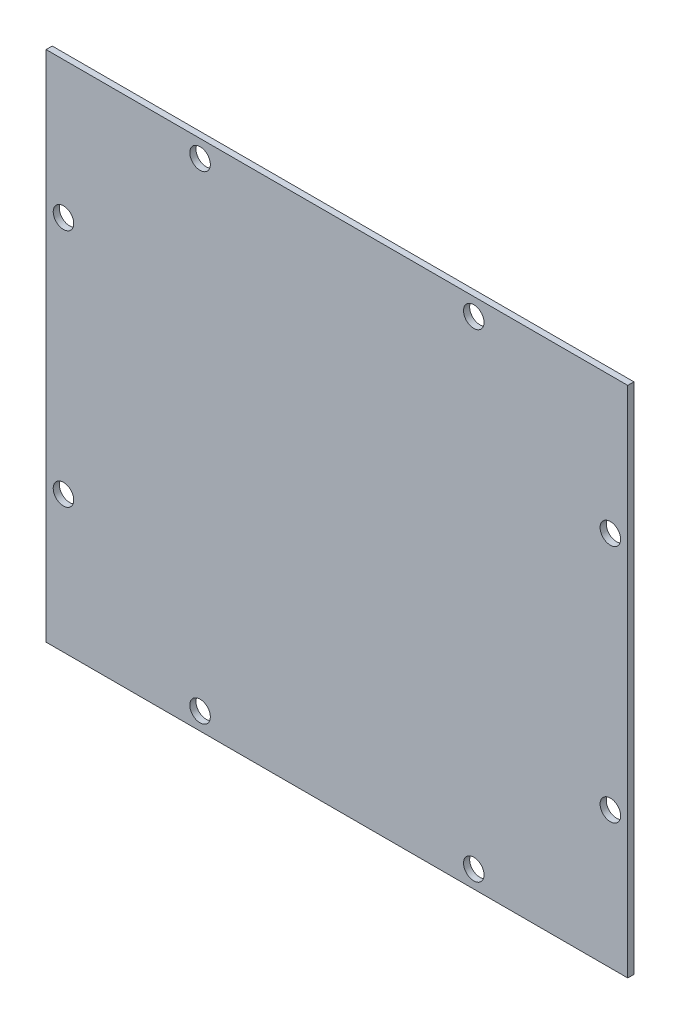
ISO-10303-21;
HEADER;
FILE_DESCRIPTION(('STEP AP214'),'2;1');
FILE_NAME('part.step','',(''),(''),'','','');
FILE_SCHEMA(('AUTOMOTIVE_DESIGN { 1 0 10303 214 1 1 1 1 }'));
ENDSEC;
DATA;
#1=APPLICATION_CONTEXT('core data for automotive mechanical design processes');
#2=APPLICATION_PROTOCOL_DEFINITION('international standard','automotive_design',2000,#1);
#3=PRODUCT_CONTEXT('',#1,'mechanical');
#4=PRODUCT('Part','Part','',(#3));
#5=PRODUCT_RELATED_PRODUCT_CATEGORY('part','',(#4));
#6=PRODUCT_DEFINITION_FORMATION('','',#4);
#7=PRODUCT_DEFINITION_CONTEXT('part definition',#1,'design');
#8=PRODUCT_DEFINITION('design','',#6,#7);
#9=PRODUCT_DEFINITION_SHAPE('','',#8);
#10=(LENGTH_UNIT() NAMED_UNIT(*) SI_UNIT(.MILLI.,.METRE.));
#11=(NAMED_UNIT(*) PLANE_ANGLE_UNIT() SI_UNIT($,.RADIAN.));
#12=(NAMED_UNIT(*) SI_UNIT($,.STERADIAN.) SOLID_ANGLE_UNIT());
#13=UNCERTAINTY_MEASURE_WITH_UNIT(LENGTH_MEASURE(1.E-05),#10,'distance_accuracy_value','');
#14=(GEOMETRIC_REPRESENTATION_CONTEXT(3) GLOBAL_UNCERTAINTY_ASSIGNED_CONTEXT((#13)) GLOBAL_UNIT_ASSIGNED_CONTEXT((#10,
#11,#12)) REPRESENTATION_CONTEXT('',''));
#15=CARTESIAN_POINT('',(0.,0.,0.));
#16=DIRECTION('',(0.,0.,1.));
#17=DIRECTION('',(1.,0.,0.));
#18=AXIS2_PLACEMENT_3D('',#15,#16,#17);
#19=CARTESIAN_POINT('',(212.5,-187.5,-4.5));
#20=DIRECTION('',(1.,0.,0.));
#21=DIRECTION('',(0.,0.,-1.));
#22=AXIS2_PLACEMENT_3D('',#19,#20,#21);
#23=PLANE('',#22);
#24=DIRECTION('',(0.,1.,0.));
#25=VECTOR('',#24,1.);
#26=CARTESIAN_POINT('',(212.5,-187.5,0.));
#27=LINE('',#26,#25);
#28=CARTESIAN_POINT('',(212.5,-187.5,0.));
#29=VERTEX_POINT('',#28);
#30=CARTESIAN_POINT('',(212.5,187.5,0.));
#31=VERTEX_POINT('',#30);
#32=EDGE_CURVE('E121',#29,#31,#27,.T.);
#33=ORIENTED_EDGE('',*,*,#32,.F.);
#34=DIRECTION('',(0.,0.,1.));
#35=VECTOR('',#34,1.);
#36=CARTESIAN_POINT('',(212.5,-187.5,-4.5));
#37=LINE('',#36,#35);
#38=CARTESIAN_POINT('',(212.5,-187.5,-4.5));
#39=VERTEX_POINT('',#38);
#40=EDGE_CURVE('E11',#39,#29,#37,.T.);
#41=ORIENTED_EDGE('',*,*,#40,.F.);
#42=DIRECTION('',(0.,1.,0.));
#43=VECTOR('',#42,1.);
#44=CARTESIAN_POINT('',(212.5,-187.5,-4.5));
#45=LINE('',#44,#43);
#46=CARTESIAN_POINT('',(212.5,187.5,-4.5));
#47=VERTEX_POINT('',#46);
#48=EDGE_CURVE('E112',#39,#47,#45,.T.);
#49=ORIENTED_EDGE('',*,*,#48,.T.);
#50=DIRECTION('',(0.,0.,1.));
#51=VECTOR('',#50,1.);
#52=CARTESIAN_POINT('',(212.5,187.5,-4.5));
#53=LINE('',#52,#51);
#54=EDGE_CURVE('E94',#47,#31,#53,.T.);
#55=ORIENTED_EDGE('',*,*,#54,.T.);
#56=EDGE_LOOP('',(#33,#41,#49,#55));
#57=FACE_BOUND('',#56,.T.);
#58=ADVANCED_FACE('F46',(#57),#23,.T.);
#59=CARTESIAN_POINT('',(-212.5,-187.5,-4.5));
#60=DIRECTION('',(0.,-1.,0.));
#61=DIRECTION('',(0.,0.,-1.));
#62=AXIS2_PLACEMENT_3D('',#59,#60,#61);
#63=PLANE('',#62);
#64=DIRECTION('',(1.,0.,0.));
#65=VECTOR('',#64,1.);
#66=CARTESIAN_POINT('',(-212.5,-187.5,0.));
#67=LINE('',#66,#65);
#68=CARTESIAN_POINT('',(-212.5,-187.5,0.));
#69=VERTEX_POINT('',#68);
#70=EDGE_CURVE('E115',#69,#29,#67,.T.);
#71=ORIENTED_EDGE('',*,*,#70,.F.);
#72=DIRECTION('',(0.,0.,1.));
#73=VECTOR('',#72,1.);
#74=CARTESIAN_POINT('',(-212.5,-187.5,-4.5));
#75=LINE('',#74,#73);
#76=CARTESIAN_POINT('',(-212.5,-187.5,-4.5));
#77=VERTEX_POINT('',#76);
#78=EDGE_CURVE('E56',#77,#69,#75,.T.);
#79=ORIENTED_EDGE('',*,*,#78,.F.);
#80=DIRECTION('',(1.,0.,0.));
#81=VECTOR('',#80,1.);
#82=CARTESIAN_POINT('',(-212.5,-187.5,-4.5));
#83=LINE('',#82,#81);
#84=EDGE_CURVE('E108',#77,#39,#83,.T.);
#85=ORIENTED_EDGE('',*,*,#84,.T.);
#86=ORIENTED_EDGE('',*,*,#40,.T.);
#87=EDGE_LOOP('',(#71,#79,#85,#86));
#88=FACE_BOUND('',#87,.T.);
#89=ADVANCED_FACE('F179',(#88),#63,.T.);
#90=CARTESIAN_POINT('',(-212.5,-187.5,-4.5));
#91=DIRECTION('',(-1.,0.,0.));
#92=DIRECTION('',(0.,0.,1.));
#93=AXIS2_PLACEMENT_3D('',#90,#91,#92);
#94=PLANE('',#93);
#95=DIRECTION('',(0.,-1.,0.));
#96=VECTOR('',#95,1.);
#97=CARTESIAN_POINT('',(-212.5,-187.5,0.));
#98=LINE('',#97,#96);
#99=CARTESIAN_POINT('',(-212.5,187.5,0.));
#100=VERTEX_POINT('',#99);
#101=EDGE_CURVE('E102',#100,#69,#98,.T.);
#102=ORIENTED_EDGE('',*,*,#101,.F.);
#103=DIRECTION('',(0.,0.,1.));
#104=VECTOR('',#103,1.);
#105=CARTESIAN_POINT('',(-212.5,187.5,-4.5));
#106=LINE('',#105,#104);
#107=CARTESIAN_POINT('',(-212.5,187.5,-4.5));
#108=VERTEX_POINT('',#107);
#109=EDGE_CURVE('E97',#108,#100,#106,.T.);
#110=ORIENTED_EDGE('',*,*,#109,.F.);
#111=DIRECTION('',(0.,-1.,0.));
#112=VECTOR('',#111,1.);
#113=CARTESIAN_POINT('',(-212.5,-187.5,-4.5));
#114=LINE('',#113,#112);
#115=EDGE_CURVE('E100',#108,#77,#114,.T.);
#116=ORIENTED_EDGE('',*,*,#115,.T.);
#117=ORIENTED_EDGE('',*,*,#78,.T.);
#118=EDGE_LOOP('',(#102,#110,#116,#117));
#119=FACE_BOUND('',#118,.T.);
#120=ADVANCED_FACE('F99',(#119),#94,.T.);
#121=CARTESIAN_POINT('',(-212.5,187.5,-4.5));
#122=DIRECTION('',(0.,1.,0.));
#123=DIRECTION('',(0.,0.,1.));
#124=AXIS2_PLACEMENT_3D('',#121,#122,#123);
#125=PLANE('',#124);
#126=DIRECTION('',(-1.,0.,0.));
#127=VECTOR('',#126,1.);
#128=CARTESIAN_POINT('',(-212.5,187.5,0.));
#129=LINE('',#128,#127);
#130=EDGE_CURVE('E125',#31,#100,#129,.T.);
#131=ORIENTED_EDGE('',*,*,#130,.F.);
#132=ORIENTED_EDGE('',*,*,#54,.F.);
#133=DIRECTION('',(-1.,0.,0.));
#134=VECTOR('',#133,1.);
#135=CARTESIAN_POINT('',(-212.5,187.5,-4.5));
#136=LINE('',#135,#134);
#137=EDGE_CURVE('E107',#47,#108,#136,.T.);
#138=ORIENTED_EDGE('',*,*,#137,.T.);
#139=ORIENTED_EDGE('',*,*,#109,.T.);
#140=EDGE_LOOP('',(#131,#132,#138,#139));
#141=FACE_BOUND('',#140,.T.);
#142=ADVANCED_FACE('F111',(#141),#125,.T.);
#143=CARTESIAN_POINT('',(0.,0.,-4.5));
#144=DIRECTION('',(0.,0.,-1.));
#145=DIRECTION('',(-1.,0.,0.));
#146=AXIS2_PLACEMENT_3D('',#143,#144,#145);
#147=PLANE('',#146);
#148=CARTESIAN_POINT('',(-100.,174.8,-4.5));
#149=DIRECTION('',(0.,0.,1.));
#150=DIRECTION('',(1.,0.,0.));
#151=AXIS2_PLACEMENT_3D('',#148,#149,#150);
#152=CIRCLE('',#151,7.5);
#153=CARTESIAN_POINT('',(-92.5,174.8,-4.5));
#154=VERTEX_POINT('',#153);
#155=EDGE_CURVE('E321',#154,#154,#152,.T.);
#156=ORIENTED_EDGE('',*,*,#155,.T.);
#157=EDGE_LOOP('',(#156));
#158=FACE_BOUND('',#157,.T.);
#159=CARTESIAN_POINT('',(100.,174.8,-4.5));
#160=DIRECTION('',(0.,0.,1.));
#161=DIRECTION('',(-1.,0.,0.));
#162=AXIS2_PLACEMENT_3D('',#159,#160,#161);
#163=CIRCLE('',#162,7.5);
#164=CARTESIAN_POINT('',(92.5,174.8,-4.5));
#165=VERTEX_POINT('',#164);
#166=EDGE_CURVE('E317',#165,#165,#163,.T.);
#167=ORIENTED_EDGE('',*,*,#166,.T.);
#168=EDGE_LOOP('',(#167));
#169=FACE_BOUND('',#168,.T.);
#170=CARTESIAN_POINT('',(199.8,87.5000000000001,-4.5));
#171=DIRECTION('',(0.,0.,1.));
#172=DIRECTION('',(-1.,0.,0.));
#173=AXIS2_PLACEMENT_3D('',#170,#171,#172);
#174=CIRCLE('',#173,7.50000000000001);
#175=CARTESIAN_POINT('',(192.3,87.5000000000001,-4.5));
#176=VERTEX_POINT('',#175);
#177=EDGE_CURVE('E298',#176,#176,#174,.T.);
#178=ORIENTED_EDGE('',*,*,#177,.T.);
#179=EDGE_LOOP('',(#178));
#180=FACE_BOUND('',#179,.T.);
#181=CARTESIAN_POINT('',(-100.,-174.8,-4.5));
#182=DIRECTION('',(0.,0.,1.));
#183=DIRECTION('',(-1.,0.,0.));
#184=AXIS2_PLACEMENT_3D('',#181,#182,#183);
#185=CIRCLE('',#184,7.5);
#186=CARTESIAN_POINT('',(-107.5,-174.8,-4.5));
#187=VERTEX_POINT('',#186);
#188=EDGE_CURVE('E318',#187,#187,#185,.T.);
#189=ORIENTED_EDGE('',*,*,#188,.T.);
#190=EDGE_LOOP('',(#189));
#191=FACE_BOUND('',#190,.T.);
#192=CARTESIAN_POINT('',(-199.8,-87.5,-4.5));
#193=DIRECTION('',(0.,0.,1.));
#194=DIRECTION('',(-1.,0.,0.));
#195=AXIS2_PLACEMENT_3D('',#192,#193,#194);
#196=CIRCLE('',#195,7.50000000000001);
#197=CARTESIAN_POINT('',(-207.3,-87.5,-4.5));
#198=VERTEX_POINT('',#197);
#199=EDGE_CURVE('E325',#198,#198,#196,.T.);
#200=ORIENTED_EDGE('',*,*,#199,.T.);
#201=EDGE_LOOP('',(#200));
#202=FACE_BOUND('',#201,.T.);
#203=CARTESIAN_POINT('',(199.8,-87.5000000000001,-4.5));
#204=DIRECTION('',(0.,0.,1.));
#205=DIRECTION('',(1.,0.,0.));
#206=AXIS2_PLACEMENT_3D('',#203,#204,#205);
#207=CIRCLE('',#206,7.50000000000001);
#208=CARTESIAN_POINT('',(207.3,-87.5000000000001,-4.5));
#209=VERTEX_POINT('',#208);
#210=EDGE_CURVE('E337',#209,#209,#207,.T.);
#211=ORIENTED_EDGE('',*,*,#210,.T.);
#212=EDGE_LOOP('',(#211));
#213=FACE_BOUND('',#212,.T.);
#214=CARTESIAN_POINT('',(100.,-174.8,-4.5));
#215=DIRECTION('',(0.,0.,1.));
#216=DIRECTION('',(1.,0.,0.));
#217=AXIS2_PLACEMENT_3D('',#214,#215,#216);
#218=CIRCLE('',#217,7.5);
#219=CARTESIAN_POINT('',(107.5,-174.8,-4.5));
#220=VERTEX_POINT('',#219);
#221=EDGE_CURVE('E333',#220,#220,#218,.T.);
#222=ORIENTED_EDGE('',*,*,#221,.T.);
#223=EDGE_LOOP('',(#222));
#224=FACE_BOUND('',#223,.T.);
#225=CARTESIAN_POINT('',(-199.8,87.5,-4.5));
#226=DIRECTION('',(0.,0.,1.));
#227=DIRECTION('',(1.,0.,0.));
#228=AXIS2_PLACEMENT_3D('',#225,#226,#227);
#229=CIRCLE('',#228,7.50000000000001);
#230=CARTESIAN_POINT('',(-192.3,87.5,-4.5));
#231=VERTEX_POINT('',#230);
#232=EDGE_CURVE('E139',#231,#231,#229,.T.);
#233=ORIENTED_EDGE('',*,*,#232,.T.);
#234=EDGE_LOOP('',(#233));
#235=FACE_BOUND('',#234,.T.);
#236=ORIENTED_EDGE('',*,*,#48,.F.);
#237=ORIENTED_EDGE('',*,*,#84,.F.);
#238=ORIENTED_EDGE('',*,*,#115,.F.);
#239=ORIENTED_EDGE('',*,*,#137,.F.);
#240=EDGE_LOOP('',(#236,#237,#238,#239));
#241=FACE_BOUND('',#240,.T.);
#242=ADVANCED_FACE('F106',(#158,#169,#180,#191,#202,#213,#224,#235,#241),#147,.T.);
#243=CARTESIAN_POINT('',(0.,0.,0.));
#244=DIRECTION('',(0.,0.,-1.));
#245=DIRECTION('',(-1.,0.,0.));
#246=AXIS2_PLACEMENT_3D('',#243,#244,#245);
#247=PLANE('',#246);
#248=CARTESIAN_POINT('',(-100.,174.8,0.));
#249=DIRECTION('',(0.,0.,-1.));
#250=DIRECTION('',(-1.,0.,0.));
#251=AXIS2_PLACEMENT_3D('',#248,#249,#250);
#252=CIRCLE('',#251,7.5);
#253=CARTESIAN_POINT('',(-107.5,174.8,0.));
#254=VERTEX_POINT('',#253);
#255=EDGE_CURVE('E49',#254,#254,#252,.T.);
#256=ORIENTED_EDGE('',*,*,#255,.T.);
#257=EDGE_LOOP('',(#256));
#258=FACE_BOUND('',#257,.T.);
#259=CARTESIAN_POINT('',(100.,174.8,0.));
#260=DIRECTION('',(0.,0.,-1.));
#261=DIRECTION('',(-1.,0.,0.));
#262=AXIS2_PLACEMENT_3D('',#259,#260,#261);
#263=CIRCLE('',#262,7.5);
#264=CARTESIAN_POINT('',(92.5,174.8,0.));
#265=VERTEX_POINT('',#264);
#266=EDGE_CURVE('E156',#265,#265,#263,.T.);
#267=ORIENTED_EDGE('',*,*,#266,.T.);
#268=EDGE_LOOP('',(#267));
#269=FACE_BOUND('',#268,.T.);
#270=CARTESIAN_POINT('',(199.8,87.5000000000001,0.));
#271=DIRECTION('',(0.,0.,-1.));
#272=DIRECTION('',(-1.,0.,0.));
#273=AXIS2_PLACEMENT_3D('',#270,#271,#272);
#274=CIRCLE('',#273,7.50000000000001);
#275=CARTESIAN_POINT('',(192.3,87.5000000000001,0.));
#276=VERTEX_POINT('',#275);
#277=EDGE_CURVE('E154',#276,#276,#274,.T.);
#278=ORIENTED_EDGE('',*,*,#277,.T.);
#279=EDGE_LOOP('',(#278));
#280=FACE_BOUND('',#279,.T.);
#281=CARTESIAN_POINT('',(-100.,-174.8,0.));
#282=DIRECTION('',(0.,0.,-1.));
#283=DIRECTION('',(-1.,0.,0.));
#284=AXIS2_PLACEMENT_3D('',#281,#282,#283);
#285=CIRCLE('',#284,7.5);
#286=CARTESIAN_POINT('',(-107.5,-174.8,0.));
#287=VERTEX_POINT('',#286);
#288=EDGE_CURVE('E150',#287,#287,#285,.T.);
#289=ORIENTED_EDGE('',*,*,#288,.T.);
#290=EDGE_LOOP('',(#289));
#291=FACE_BOUND('',#290,.T.);
#292=CARTESIAN_POINT('',(-199.8,-87.5,0.));
#293=DIRECTION('',(0.,0.,-1.));
#294=DIRECTION('',(-1.,0.,0.));
#295=AXIS2_PLACEMENT_3D('',#292,#293,#294);
#296=CIRCLE('',#295,7.50000000000001);
#297=CARTESIAN_POINT('',(-207.3,-87.5,0.));
#298=VERTEX_POINT('',#297);
#299=EDGE_CURVE('E146',#298,#298,#296,.T.);
#300=ORIENTED_EDGE('',*,*,#299,.T.);
#301=EDGE_LOOP('',(#300));
#302=FACE_BOUND('',#301,.T.);
#303=CARTESIAN_POINT('',(199.8,-87.5000000000001,0.));
#304=DIRECTION('',(0.,0.,-1.));
#305=DIRECTION('',(-1.,0.,0.));
#306=AXIS2_PLACEMENT_3D('',#303,#304,#305);
#307=CIRCLE('',#306,7.50000000000001);
#308=CARTESIAN_POINT('',(192.3,-87.5000000000001,0.));
#309=VERTEX_POINT('',#308);
#310=EDGE_CURVE('E143',#309,#309,#307,.T.);
#311=ORIENTED_EDGE('',*,*,#310,.T.);
#312=EDGE_LOOP('',(#311));
#313=FACE_BOUND('',#312,.T.);
#314=CARTESIAN_POINT('',(100.,-174.8,0.));
#315=DIRECTION('',(0.,0.,-1.));
#316=DIRECTION('',(-1.,0.,0.));
#317=AXIS2_PLACEMENT_3D('',#314,#315,#316);
#318=CIRCLE('',#317,7.5);
#319=CARTESIAN_POINT('',(92.5,-174.8,0.));
#320=VERTEX_POINT('',#319);
#321=EDGE_CURVE('E138',#320,#320,#318,.T.);
#322=ORIENTED_EDGE('',*,*,#321,.T.);
#323=EDGE_LOOP('',(#322));
#324=FACE_BOUND('',#323,.T.);
#325=CARTESIAN_POINT('',(-199.8,87.5,0.));
#326=DIRECTION('',(0.,0.,-1.));
#327=DIRECTION('',(-1.,0.,0.));
#328=AXIS2_PLACEMENT_3D('',#325,#326,#327);
#329=CIRCLE('',#328,7.50000000000001);
#330=CARTESIAN_POINT('',(-207.3,87.5,0.));
#331=VERTEX_POINT('',#330);
#332=EDGE_CURVE('E135',#331,#331,#329,.T.);
#333=ORIENTED_EDGE('',*,*,#332,.T.);
#334=EDGE_LOOP('',(#333));
#335=FACE_BOUND('',#334,.T.);
#336=ORIENTED_EDGE('',*,*,#32,.T.);
#337=ORIENTED_EDGE('',*,*,#130,.T.);
#338=ORIENTED_EDGE('',*,*,#101,.T.);
#339=ORIENTED_EDGE('',*,*,#70,.T.);
#340=EDGE_LOOP('',(#336,#337,#338,#339));
#341=FACE_BOUND('',#340,.T.);
#342=ADVANCED_FACE('F163',(#258,#269,#280,#291,#302,#313,#324,#335,#341),#247,.F.);
#343=CARTESIAN_POINT('',(-199.8,87.5,-4.5));
#344=DIRECTION('',(0.,0.,1.));
#345=DIRECTION('',(1.,0.,0.));
#346=AXIS2_PLACEMENT_3D('',#343,#344,#345);
#347=CYLINDRICAL_SURFACE('',#346,7.50000000000001);
#348=ORIENTED_EDGE('',*,*,#232,.F.);
#349=EDGE_LOOP('',(#348));
#350=FACE_BOUND('',#349,.T.);
#351=ORIENTED_EDGE('',*,*,#332,.F.);
#352=EDGE_LOOP('',(#351));
#353=FACE_BOUND('',#352,.T.);
#354=ADVANCED_FACE('F186',(#350,#353),#347,.F.);
#355=CARTESIAN_POINT('',(100.,-174.8,-4.5));
#356=DIRECTION('',(0.,0.,1.));
#357=DIRECTION('',(1.,0.,0.));
#358=AXIS2_PLACEMENT_3D('',#355,#356,#357);
#359=CYLINDRICAL_SURFACE('',#358,7.5);
#360=ORIENTED_EDGE('',*,*,#221,.F.);
#361=EDGE_LOOP('',(#360));
#362=FACE_BOUND('',#361,.T.);
#363=ORIENTED_EDGE('',*,*,#321,.F.);
#364=EDGE_LOOP('',(#363));
#365=FACE_BOUND('',#364,.T.);
#366=ADVANCED_FACE('F192',(#362,#365),#359,.F.);
#367=CARTESIAN_POINT('',(199.8,-87.5000000000001,-4.5));
#368=DIRECTION('',(0.,0.,1.));
#369=DIRECTION('',(1.,0.,0.));
#370=AXIS2_PLACEMENT_3D('',#367,#368,#369);
#371=CYLINDRICAL_SURFACE('',#370,7.50000000000001);
#372=ORIENTED_EDGE('',*,*,#210,.F.);
#373=EDGE_LOOP('',(#372));
#374=FACE_BOUND('',#373,.T.);
#375=ORIENTED_EDGE('',*,*,#310,.F.);
#376=EDGE_LOOP('',(#375));
#377=FACE_BOUND('',#376,.T.);
#378=ADVANCED_FACE('F228',(#374,#377),#371,.F.);
#379=CARTESIAN_POINT('',(-199.8,-87.5,-4.5));
#380=DIRECTION('',(0.,0.,1.));
#381=DIRECTION('',(1.,0.,0.));
#382=AXIS2_PLACEMENT_3D('',#379,#380,#381);
#383=CYLINDRICAL_SURFACE('',#382,7.50000000000001);
#384=ORIENTED_EDGE('',*,*,#199,.F.);
#385=EDGE_LOOP('',(#384));
#386=FACE_BOUND('',#385,.T.);
#387=ORIENTED_EDGE('',*,*,#299,.F.);
#388=EDGE_LOOP('',(#387));
#389=FACE_BOUND('',#388,.T.);
#390=ADVANCED_FACE('F238',(#386,#389),#383,.F.);
#391=CARTESIAN_POINT('',(-100.,-174.8,-4.5));
#392=DIRECTION('',(0.,0.,1.));
#393=DIRECTION('',(1.,0.,0.));
#394=AXIS2_PLACEMENT_3D('',#391,#392,#393);
#395=CYLINDRICAL_SURFACE('',#394,7.5);
#396=ORIENTED_EDGE('',*,*,#188,.F.);
#397=EDGE_LOOP('',(#396));
#398=FACE_BOUND('',#397,.T.);
#399=ORIENTED_EDGE('',*,*,#288,.F.);
#400=EDGE_LOOP('',(#399));
#401=FACE_BOUND('',#400,.T.);
#402=ADVANCED_FACE('F249',(#398,#401),#395,.F.);
#403=CARTESIAN_POINT('',(199.8,87.5000000000001,-4.5));
#404=DIRECTION('',(0.,0.,1.));
#405=DIRECTION('',(1.,0.,0.));
#406=AXIS2_PLACEMENT_3D('',#403,#404,#405);
#407=CYLINDRICAL_SURFACE('',#406,7.50000000000001);
#408=ORIENTED_EDGE('',*,*,#177,.F.);
#409=EDGE_LOOP('',(#408));
#410=FACE_BOUND('',#409,.T.);
#411=ORIENTED_EDGE('',*,*,#277,.F.);
#412=EDGE_LOOP('',(#411));
#413=FACE_BOUND('',#412,.T.);
#414=ADVANCED_FACE('F173',(#410,#413),#407,.F.);
#415=CARTESIAN_POINT('',(100.,174.8,-4.5));
#416=DIRECTION('',(0.,0.,1.));
#417=DIRECTION('',(1.,0.,0.));
#418=AXIS2_PLACEMENT_3D('',#415,#416,#417);
#419=CYLINDRICAL_SURFACE('',#418,7.5);
#420=ORIENTED_EDGE('',*,*,#166,.F.);
#421=EDGE_LOOP('',(#420));
#422=FACE_BOUND('',#421,.T.);
#423=ORIENTED_EDGE('',*,*,#266,.F.);
#424=EDGE_LOOP('',(#423));
#425=FACE_BOUND('',#424,.T.);
#426=ADVANCED_FACE('F167',(#422,#425),#419,.F.);
#427=CARTESIAN_POINT('',(-100.,174.8,-4.5));
#428=DIRECTION('',(0.,0.,1.));
#429=DIRECTION('',(1.,0.,0.));
#430=AXIS2_PLACEMENT_3D('',#427,#428,#429);
#431=CYLINDRICAL_SURFACE('',#430,7.5);
#432=ORIENTED_EDGE('',*,*,#155,.F.);
#433=EDGE_LOOP('',(#432));
#434=FACE_BOUND('',#433,.T.);
#435=ORIENTED_EDGE('',*,*,#255,.F.);
#436=EDGE_LOOP('',(#435));
#437=FACE_BOUND('',#436,.T.);
#438=ADVANCED_FACE('F165',(#434,#437),#431,.F.);
#439=CLOSED_SHELL('',(#58,#89,#120,#142,#242,#342,#354,#366,#378,#390,#402,#414,#426,#438));
#440=MANIFOLD_SOLID_BREP('B2',#439);
#441=ADVANCED_BREP_SHAPE_REPRESENTATION('',(#18,#440),#14);
#442=SHAPE_DEFINITION_REPRESENTATION(#9,#441);
ENDSEC;
END-ISO-10303-21;
